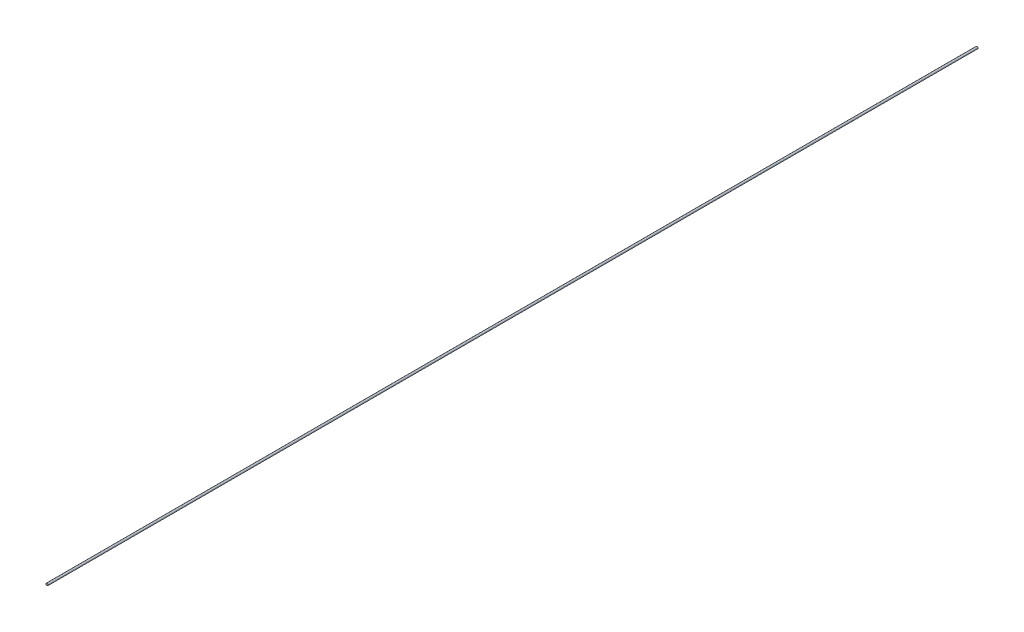
ISO-10303-21;
HEADER;
FILE_DESCRIPTION(('STEP AP214'),'2;1');
FILE_NAME('part.step','',(''),(''),'','','');
FILE_SCHEMA(('AUTOMOTIVE_DESIGN { 1 0 10303 214 1 1 1 1 }'));
ENDSEC;
DATA;
#1=APPLICATION_CONTEXT('core data for automotive mechanical design processes');
#2=APPLICATION_PROTOCOL_DEFINITION('international standard','automotive_design',2000,#1);
#3=PRODUCT_CONTEXT('',#1,'mechanical');
#4=PRODUCT('Part','Part','',(#3));
#5=PRODUCT_RELATED_PRODUCT_CATEGORY('part','',(#4));
#6=PRODUCT_DEFINITION_FORMATION('','',#4);
#7=PRODUCT_DEFINITION_CONTEXT('part definition',#1,'design');
#8=PRODUCT_DEFINITION('design','',#6,#7);
#9=PRODUCT_DEFINITION_SHAPE('','',#8);
#10=(LENGTH_UNIT() NAMED_UNIT(*) SI_UNIT(.MILLI.,.METRE.));
#11=(NAMED_UNIT(*) PLANE_ANGLE_UNIT() SI_UNIT($,.RADIAN.));
#12=(NAMED_UNIT(*) SI_UNIT($,.STERADIAN.) SOLID_ANGLE_UNIT());
#13=UNCERTAINTY_MEASURE_WITH_UNIT(LENGTH_MEASURE(1.E-05),#10,'distance_accuracy_value','');
#14=(GEOMETRIC_REPRESENTATION_CONTEXT(3) GLOBAL_UNCERTAINTY_ASSIGNED_CONTEXT((#13)) GLOBAL_UNIT_ASSIGNED_CONTEXT((#10,
#11,#12)) REPRESENTATION_CONTEXT('',''));
#15=CARTESIAN_POINT('',(0.,0.,0.));
#16=DIRECTION('',(0.,0.,1.));
#17=DIRECTION('',(1.,0.,0.));
#18=AXIS2_PLACEMENT_3D('',#15,#16,#17);
#19=CARTESIAN_POINT('',(0.,0.,-1229.52888776));
#20=DIRECTION('',(0.,0.,1.));
#21=DIRECTION('',(1.,0.,0.));
#22=AXIS2_PLACEMENT_3D('',#19,#20,#21);
#23=CYLINDRICAL_SURFACE('',#22,2.75);
#24=CARTESIAN_POINT('',(0.,0.,-1229.52888776));
#25=DIRECTION('',(0.,0.,1.));
#26=DIRECTION('',(1.,0.,0.));
#27=AXIS2_PLACEMENT_3D('',#24,#25,#26);
#28=CIRCLE('',#27,2.75);
#29=CARTESIAN_POINT('',(2.75,0.,-1229.52888776));
#30=VERTEX_POINT('',#29);
#31=EDGE_CURVE('E10',#30,#30,#28,.T.);
#32=ORIENTED_EDGE('',*,*,#31,.T.);
#33=EDGE_LOOP('',(#32));
#34=FACE_BOUND('',#33,.T.);
#35=CARTESIAN_POINT('',(0.,0.,1229.52888776));
#36=DIRECTION('',(0.,0.,1.));
#37=DIRECTION('',(1.,0.,0.));
#38=AXIS2_PLACEMENT_3D('',#35,#36,#37);
#39=CIRCLE('',#38,2.75);
#40=CARTESIAN_POINT('',(2.75,0.,1229.52888776));
#41=VERTEX_POINT('',#40);
#42=EDGE_CURVE('E45',#41,#41,#39,.T.);
#43=ORIENTED_EDGE('',*,*,#42,.F.);
#44=EDGE_LOOP('',(#43));
#45=FACE_BOUND('',#44,.T.);
#46=ADVANCED_FACE('F35',(#34,#45),#23,.T.);
#47=CARTESIAN_POINT('',(0.,0.,-1229.52888776));
#48=DIRECTION('',(0.,0.,1.));
#49=DIRECTION('',(1.,0.,0.));
#50=AXIS2_PLACEMENT_3D('',#47,#48,#49);
#51=PLANE('',#50);
#52=CARTESIAN_POINT('',(0.,0.,-1229.52888776));
#53=DIRECTION('',(0.,0.,1.));
#54=DIRECTION('',(1.,0.,0.));
#55=AXIS2_PLACEMENT_3D('',#52,#53,#54);
#56=CIRCLE('',#55,0.5);
#57=CARTESIAN_POINT('',(0.5,0.,-1229.52888776));
#58=VERTEX_POINT('',#57);
#59=EDGE_CURVE('E41',#58,#58,#56,.T.);
#60=ORIENTED_EDGE('',*,*,#59,.T.);
#61=EDGE_LOOP('',(#60));
#62=FACE_BOUND('',#61,.T.);
#63=ORIENTED_EDGE('',*,*,#31,.F.);
#64=EDGE_LOOP('',(#63));
#65=FACE_BOUND('',#64,.T.);
#66=ADVANCED_FACE('F64',(#62,#65),#51,.F.);
#67=CARTESIAN_POINT('',(0.,0.,-1229.52888776));
#68=DIRECTION('',(0.,0.,1.));
#69=DIRECTION('',(1.,0.,0.));
#70=AXIS2_PLACEMENT_3D('',#67,#68,#69);
#71=CYLINDRICAL_SURFACE('',#70,0.5);
#72=ORIENTED_EDGE('',*,*,#59,.F.);
#73=EDGE_LOOP('',(#72));
#74=FACE_BOUND('',#73,.T.);
#75=CARTESIAN_POINT('',(0.,0.,1229.52888776));
#76=DIRECTION('',(0.,0.,1.));
#77=DIRECTION('',(1.,0.,0.));
#78=AXIS2_PLACEMENT_3D('',#75,#76,#77);
#79=CIRCLE('',#78,0.5);
#80=CARTESIAN_POINT('',(0.5,0.,1229.52888776));
#81=VERTEX_POINT('',#80);
#82=EDGE_CURVE('E49',#81,#81,#79,.T.);
#83=ORIENTED_EDGE('',*,*,#82,.T.);
#84=EDGE_LOOP('',(#83));
#85=FACE_BOUND('',#84,.T.);
#86=ADVANCED_FACE('F55',(#74,#85),#71,.F.);
#87=CARTESIAN_POINT('',(0.,0.,1229.52888776));
#88=DIRECTION('',(0.,0.,1.));
#89=DIRECTION('',(1.,0.,0.));
#90=AXIS2_PLACEMENT_3D('',#87,#88,#89);
#91=PLANE('',#90);
#92=ORIENTED_EDGE('',*,*,#42,.T.);
#93=EDGE_LOOP('',(#92));
#94=FACE_BOUND('',#93,.T.);
#95=ORIENTED_EDGE('',*,*,#82,.F.);
#96=EDGE_LOOP('',(#95));
#97=FACE_BOUND('',#96,.T.);
#98=ADVANCED_FACE('F57',(#94,#97),#91,.T.);
#99=CLOSED_SHELL('',(#46,#66,#86,#98));
#100=MANIFOLD_SOLID_BREP('B2',#99);
#101=ADVANCED_BREP_SHAPE_REPRESENTATION('',(#18,#100),#14);
#102=SHAPE_DEFINITION_REPRESENTATION(#9,#101);
ENDSEC;
END-ISO-10303-21;
